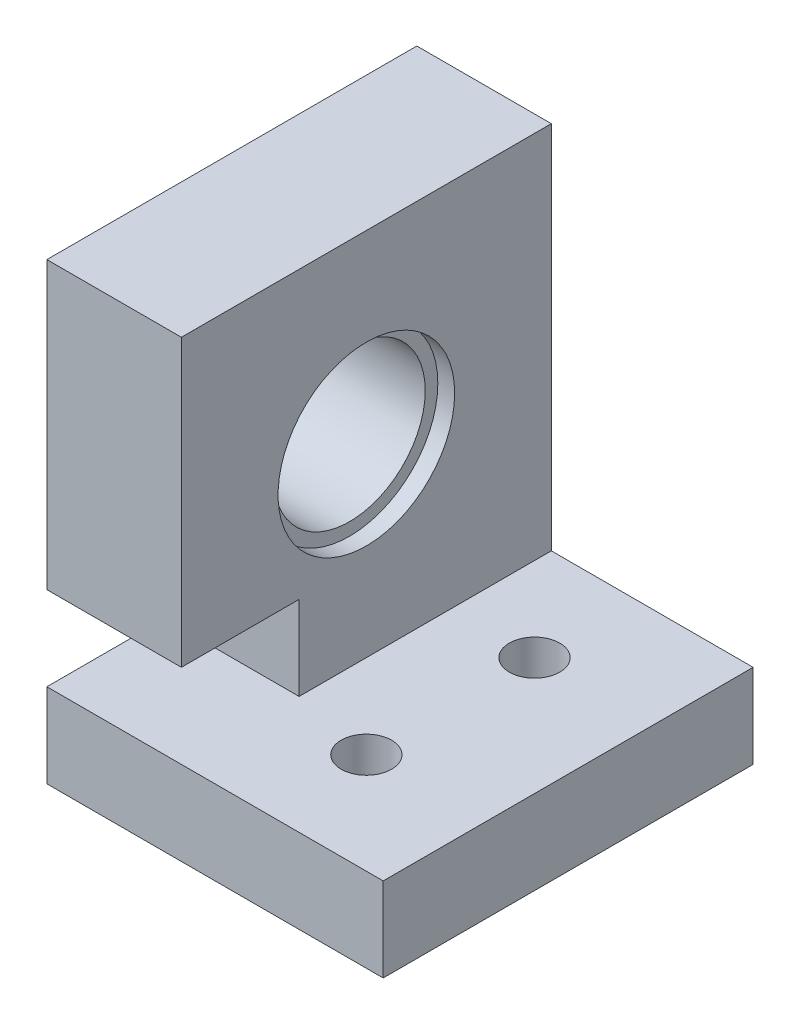
ISO-10303-21;
HEADER;
FILE_DESCRIPTION(('STEP AP214'),'2;1');
FILE_NAME('part.step','',(''),(''),'','','');
FILE_SCHEMA(('AUTOMOTIVE_DESIGN { 1 0 10303 214 1 1 1 1 }'));
ENDSEC;
DATA;
#1=APPLICATION_CONTEXT('core data for automotive mechanical design processes');
#2=APPLICATION_PROTOCOL_DEFINITION('international standard','automotive_design',2000,#1);
#3=PRODUCT_CONTEXT('',#1,'mechanical');
#4=PRODUCT('Part','Part','',(#3));
#5=PRODUCT_RELATED_PRODUCT_CATEGORY('part','',(#4));
#6=PRODUCT_DEFINITION_FORMATION('','',#4);
#7=PRODUCT_DEFINITION_CONTEXT('part definition',#1,'design');
#8=PRODUCT_DEFINITION('design','',#6,#7);
#9=PRODUCT_DEFINITION_SHAPE('','',#8);
#10=(LENGTH_UNIT() NAMED_UNIT(*) SI_UNIT(.MILLI.,.METRE.));
#11=(NAMED_UNIT(*) PLANE_ANGLE_UNIT() SI_UNIT($,.RADIAN.));
#12=(NAMED_UNIT(*) SI_UNIT($,.STERADIAN.) SOLID_ANGLE_UNIT());
#13=UNCERTAINTY_MEASURE_WITH_UNIT(LENGTH_MEASURE(1.E-05),#10,'distance_accuracy_value','');
#14=(GEOMETRIC_REPRESENTATION_CONTEXT(3) GLOBAL_UNCERTAINTY_ASSIGNED_CONTEXT((#13)) GLOBAL_UNIT_ASSIGNED_CONTEXT((#10,
#11,#12)) REPRESENTATION_CONTEXT('',''));
#15=CARTESIAN_POINT('',(0.,0.,0.));
#16=DIRECTION('',(0.,0.,1.));
#17=DIRECTION('',(1.,0.,0.));
#18=AXIS2_PLACEMENT_3D('',#15,#16,#17);
#19=CARTESIAN_POINT('',(13.,15.,-5.));
#20=DIRECTION('',(0.,-1.,0.));
#21=DIRECTION('',(0.,0.,-1.));
#22=AXIS2_PLACEMENT_3D('',#19,#20,#21);
#23=CYLINDRICAL_SURFACE('',#22,1.5);
#24=CARTESIAN_POINT('',(13.,-7.00000000000001,-5.));
#25=DIRECTION('',(0.,-1.,0.));
#26=DIRECTION('',(0.,0.,-1.));
#27=AXIS2_PLACEMENT_3D('',#24,#25,#26);
#28=CIRCLE('',#27,1.5);
#29=CARTESIAN_POINT('',(13.,-7.00000000000001,-6.5));
#30=VERTEX_POINT('',#29);
#31=EDGE_CURVE('E299',#30,#30,#28,.T.);
#32=ORIENTED_EDGE('',*,*,#31,.F.);
#33=EDGE_LOOP('',(#32));
#34=FACE_BOUND('',#33,.T.);
#35=CARTESIAN_POINT('',(13.,-9.50000000000001,-5.));
#36=DIRECTION('',(0.,-1.,0.));
#37=DIRECTION('',(0.,0.,-1.));
#38=AXIS2_PLACEMENT_3D('',#35,#36,#37);
#39=CIRCLE('',#38,1.5);
#40=CARTESIAN_POINT('',(13.,-9.50000000000001,-6.5));
#41=VERTEX_POINT('',#40);
#42=EDGE_CURVE('E307',#41,#41,#39,.F.);
#43=ORIENTED_EDGE('',*,*,#42,.F.);
#44=EDGE_LOOP('',(#43));
#45=FACE_BOUND('',#44,.T.);
#46=ADVANCED_FACE('F39',(#34,#45),#23,.F.);
#47=CARTESIAN_POINT('',(13.,15.,5.));
#48=DIRECTION('',(0.,-1.,0.));
#49=DIRECTION('',(0.,0.,-1.));
#50=AXIS2_PLACEMENT_3D('',#47,#48,#49);
#51=CYLINDRICAL_SURFACE('',#50,1.5);
#52=CARTESIAN_POINT('',(13.,-7.00000000000001,5.));
#53=DIRECTION('',(0.,-1.,0.));
#54=DIRECTION('',(0.,0.,-1.));
#55=AXIS2_PLACEMENT_3D('',#52,#53,#54);
#56=CIRCLE('',#55,1.5);
#57=CARTESIAN_POINT('',(13.,-7.00000000000001,3.5));
#58=VERTEX_POINT('',#57);
#59=EDGE_CURVE('E294',#58,#58,#56,.T.);
#60=ORIENTED_EDGE('',*,*,#59,.F.);
#61=EDGE_LOOP('',(#60));
#62=FACE_BOUND('',#61,.T.);
#63=CARTESIAN_POINT('',(13.,-9.50000000000001,5.));
#64=DIRECTION('',(0.,-1.,0.));
#65=DIRECTION('',(0.,0.,-1.));
#66=AXIS2_PLACEMENT_3D('',#63,#64,#65);
#67=CIRCLE('',#66,1.5);
#68=CARTESIAN_POINT('',(13.,-9.50000000000001,3.5));
#69=VERTEX_POINT('',#68);
#70=EDGE_CURVE('E303',#69,#69,#67,.F.);
#71=ORIENTED_EDGE('',*,*,#70,.F.);
#72=EDGE_LOOP('',(#71));
#73=FACE_BOUND('',#72,.T.);
#74=ADVANCED_FACE('F523',(#62,#73),#51,.F.);
#75=CARTESIAN_POINT('',(8.,0.,0.));
#76=DIRECTION('',(-1.,0.,0.));
#77=DIRECTION('',(0.,0.,1.));
#78=AXIS2_PLACEMENT_3D('',#75,#76,#77);
#79=PLANE('',#78);
#80=CARTESIAN_POINT('',(8.,4.,0.));
#81=DIRECTION('',(1.,0.,0.));
#82=DIRECTION('',(0.,0.,-1.));
#83=AXIS2_PLACEMENT_3D('',#80,#81,#82);
#84=CIRCLE('',#83,5.25);
#85=CARTESIAN_POINT('',(8.,4.,-5.25));
#86=VERTEX_POINT('',#85);
#87=EDGE_CURVE('E211',#86,#86,#84,.T.);
#88=ORIENTED_EDGE('',*,*,#87,.F.);
#89=EDGE_LOOP('',(#88));
#90=FACE_BOUND('',#89,.T.);
#91=DIRECTION('',(0.,0.,1.));
#92=VECTOR('',#91,1.);
#93=CARTESIAN_POINT('',(8.,-7.00000000000001,4.));
#94=LINE('',#93,#92);
#95=CARTESIAN_POINT('',(8.,-7.00000000000001,-11.));
#96=VERTEX_POINT('',#95);
#97=CARTESIAN_POINT('',(8.,-7.00000000000001,4.));
#98=VERTEX_POINT('',#97);
#99=EDGE_CURVE('E360',#96,#98,#94,.T.);
#100=ORIENTED_EDGE('',*,*,#99,.F.);
#101=DIRECTION('',(0.,-1.,0.));
#102=VECTOR('',#101,1.);
#103=CARTESIAN_POINT('',(8.,15.,-11.));
#104=LINE('',#103,#102);
#105=CARTESIAN_POINT('',(8.,15.,-11.));
#106=VERTEX_POINT('',#105);
#107=EDGE_CURVE('E260',#106,#96,#104,.T.);
#108=ORIENTED_EDGE('',*,*,#107,.F.);
#109=DIRECTION('',(0.,0.,-1.));
#110=VECTOR('',#109,1.);
#111=CARTESIAN_POINT('',(8.,15.,11.));
#112=LINE('',#111,#110);
#113=CARTESIAN_POINT('',(8.,15.,11.));
#114=VERTEX_POINT('',#113);
#115=EDGE_CURVE('E264',#114,#106,#112,.T.);
#116=ORIENTED_EDGE('',*,*,#115,.F.);
#117=DIRECTION('',(0.,-1.,0.));
#118=VECTOR('',#117,1.);
#119=CARTESIAN_POINT('',(8.,15.,11.));
#120=LINE('',#119,#118);
#121=CARTESIAN_POINT('',(8.,-2.,11.));
#122=VERTEX_POINT('',#121);
#123=EDGE_CURVE('E269',#114,#122,#120,.T.);
#124=ORIENTED_EDGE('',*,*,#123,.T.);
#125=DIRECTION('',(0.,0.,-1.));
#126=VECTOR('',#125,1.);
#127=CARTESIAN_POINT('',(8.,-2.,11.));
#128=LINE('',#127,#126);
#129=CARTESIAN_POINT('',(8.,-2.,4.));
#130=VERTEX_POINT('',#129);
#131=EDGE_CURVE('E237',#122,#130,#128,.T.);
#132=ORIENTED_EDGE('',*,*,#131,.T.);
#133=DIRECTION('',(0.,-1.,0.));
#134=VECTOR('',#133,1.);
#135=CARTESIAN_POINT('',(8.,-10.,4.));
#136=LINE('',#135,#134);
#137=EDGE_CURVE('E241',#130,#98,#136,.T.);
#138=ORIENTED_EDGE('',*,*,#137,.T.);
#139=EDGE_LOOP('',(#100,#108,#116,#124,#132,#138));
#140=FACE_BOUND('',#139,.T.);
#141=ADVANCED_FACE('F493',(#90,#140),#79,.F.);
#142=CARTESIAN_POINT('',(8.,-10.,4.));
#143=DIRECTION('',(0.,0.,-1.));
#144=DIRECTION('',(-1.,0.,0.));
#145=AXIS2_PLACEMENT_3D('',#142,#143,#144);
#146=PLANE('',#145);
#147=DIRECTION('',(-1.,0.,0.));
#148=VECTOR('',#147,1.);
#149=CARTESIAN_POINT('',(0.,-7.00000000000001,4.));
#150=LINE('',#149,#148);
#151=CARTESIAN_POINT('',(0.,-7.00000000000001,4.));
#152=VERTEX_POINT('',#151);
#153=EDGE_CURVE('E363',#98,#152,#150,.T.);
#154=ORIENTED_EDGE('',*,*,#153,.F.);
#155=ORIENTED_EDGE('',*,*,#137,.F.);
#156=DIRECTION('',(-1.,0.,0.));
#157=VECTOR('',#156,1.);
#158=CARTESIAN_POINT('',(8.,-2.,4.));
#159=LINE('',#158,#157);
#160=CARTESIAN_POINT('',(0.,-2.,4.));
#161=VERTEX_POINT('',#160);
#162=EDGE_CURVE('E254',#130,#161,#159,.T.);
#163=ORIENTED_EDGE('',*,*,#162,.T.);
#164=DIRECTION('',(0.,-1.,0.));
#165=VECTOR('',#164,1.);
#166=CARTESIAN_POINT('',(0.,-10.,4.));
#167=LINE('',#166,#165);
#168=EDGE_CURVE('E242',#161,#152,#167,.T.);
#169=ORIENTED_EDGE('',*,*,#168,.T.);
#170=EDGE_LOOP('',(#154,#155,#163,#169));
#171=FACE_BOUND('',#170,.T.);
#172=ADVANCED_FACE('F500',(#171),#146,.F.);
#173=CARTESIAN_POINT('',(8.,4.,0.));
#174=DIRECTION('',(-1.,0.,0.));
#175=DIRECTION('',(0.,0.,1.));
#176=AXIS2_PLACEMENT_3D('',#173,#174,#175);
#177=CYLINDRICAL_SURFACE('',#176,4.5);
#178=CARTESIAN_POINT('',(1.,4.,0.));
#179=DIRECTION('',(-1.,0.,0.));
#180=DIRECTION('',(0.,0.,1.));
#181=AXIS2_PLACEMENT_3D('',#178,#179,#180);
#182=CIRCLE('',#181,4.5);
#183=CARTESIAN_POINT('',(1.,4.,4.5));
#184=VERTEX_POINT('',#183);
#185=EDGE_CURVE('E232',#184,#184,#182,.F.);
#186=ORIENTED_EDGE('',*,*,#185,.F.);
#187=EDGE_LOOP('',(#186));
#188=FACE_BOUND('',#187,.T.);
#189=CARTESIAN_POINT('',(7.,4.,0.));
#190=DIRECTION('',(1.,0.,0.));
#191=DIRECTION('',(0.,0.,-1.));
#192=AXIS2_PLACEMENT_3D('',#189,#190,#191);
#193=CIRCLE('',#192,4.5);
#194=CARTESIAN_POINT('',(7.,4.,-4.5));
#195=VERTEX_POINT('',#194);
#196=EDGE_CURVE('E224',#195,#195,#193,.F.);
#197=ORIENTED_EDGE('',*,*,#196,.F.);
#198=EDGE_LOOP('',(#197));
#199=FACE_BOUND('',#198,.T.);
#200=ADVANCED_FACE('F589',(#188,#199),#177,.F.);
#201=CARTESIAN_POINT('',(8.,15.,11.));
#202=DIRECTION('',(0.,0.,-1.));
#203=DIRECTION('',(0.,1.,0.));
#204=AXIS2_PLACEMENT_3D('',#201,#202,#203);
#205=PLANE('',#204);
#206=DIRECTION('',(0.,-1.,0.));
#207=VECTOR('',#206,1.);
#208=CARTESIAN_POINT('',(0.,15.,11.));
#209=LINE('',#208,#207);
#210=CARTESIAN_POINT('',(0.,-7.00000000000001,11.));
#211=VERTEX_POINT('',#210);
#212=CARTESIAN_POINT('',(0.,-12.,11.));
#213=VERTEX_POINT('',#212);
#214=EDGE_CURVE('E197',#211,#213,#209,.T.);
#215=ORIENTED_EDGE('',*,*,#214,.T.);
#216=DIRECTION('',(-1.,0.,0.));
#217=VECTOR('',#216,1.);
#218=CARTESIAN_POINT('',(20.,-12.,11.));
#219=LINE('',#218,#217);
#220=CARTESIAN_POINT('',(20.,-12.,11.));
#221=VERTEX_POINT('',#220);
#222=EDGE_CURVE('E184',#221,#213,#219,.T.);
#223=ORIENTED_EDGE('',*,*,#222,.F.);
#224=DIRECTION('',(0.,-1.,0.));
#225=VECTOR('',#224,1.);
#226=CARTESIAN_POINT('',(20.,-10.,11.));
#227=LINE('',#226,#225);
#228=CARTESIAN_POINT('',(20.,-7.00000000000001,11.));
#229=VERTEX_POINT('',#228);
#230=EDGE_CURVE('E195',#229,#221,#227,.T.);
#231=ORIENTED_EDGE('',*,*,#230,.F.);
#232=DIRECTION('',(1.,0.,0.));
#233=VECTOR('',#232,1.);
#234=CARTESIAN_POINT('',(20.,-7.00000000000001,11.));
#235=LINE('',#234,#233);
#236=EDGE_CURVE('E352',#211,#229,#235,.T.);
#237=ORIENTED_EDGE('',*,*,#236,.F.);
#238=EDGE_LOOP('',(#215,#223,#231,#237));
#239=FACE_BOUND('',#238,.T.);
#240=ADVANCED_FACE('F193',(#239),#205,.F.);
#241=CARTESIAN_POINT('',(8.,15.,-11.));
#242=DIRECTION('',(0.,0.,-1.));
#243=DIRECTION('',(0.,1.,0.));
#244=AXIS2_PLACEMENT_3D('',#241,#242,#243);
#245=PLANE('',#244);
#246=DIRECTION('',(1.,0.,0.));
#247=VECTOR('',#246,1.);
#248=CARTESIAN_POINT('',(20.,-12.,-11.));
#249=LINE('',#248,#247);
#250=CARTESIAN_POINT('',(0.,-12.,-11.));
#251=VERTEX_POINT('',#250);
#252=CARTESIAN_POINT('',(20.,-12.,-11.));
#253=VERTEX_POINT('',#252);
#254=EDGE_CURVE('E55',#251,#253,#249,.T.);
#255=ORIENTED_EDGE('',*,*,#254,.F.);
#256=DIRECTION('',(0.,-1.,0.));
#257=VECTOR('',#256,1.);
#258=CARTESIAN_POINT('',(0.,15.,-11.));
#259=LINE('',#258,#257);
#260=CARTESIAN_POINT('',(0.,15.,-11.));
#261=VERTEX_POINT('',#260);
#262=EDGE_CURVE('E257',#261,#251,#259,.T.);
#263=ORIENTED_EDGE('',*,*,#262,.F.);
#264=DIRECTION('',(-1.,0.,0.));
#265=VECTOR('',#264,1.);
#266=CARTESIAN_POINT('',(8.,15.,-11.));
#267=LINE('',#266,#265);
#268=EDGE_CURVE('E48',#106,#261,#267,.T.);
#269=ORIENTED_EDGE('',*,*,#268,.F.);
#270=ORIENTED_EDGE('',*,*,#107,.T.);
#271=DIRECTION('',(-1.,0.,0.));
#272=VECTOR('',#271,1.);
#273=CARTESIAN_POINT('',(8.,-7.00000000000001,-11.));
#274=LINE('',#273,#272);
#275=CARTESIAN_POINT('',(20.,-7.00000000000001,-11.));
#276=VERTEX_POINT('',#275);
#277=EDGE_CURVE('E357',#276,#96,#274,.T.);
#278=ORIENTED_EDGE('',*,*,#277,.F.);
#279=DIRECTION('',(0.,1.,0.));
#280=VECTOR('',#279,1.);
#281=CARTESIAN_POINT('',(20.,-10.,-11.));
#282=LINE('',#281,#280);
#283=EDGE_CURVE('E206',#253,#276,#282,.T.);
#284=ORIENTED_EDGE('',*,*,#283,.F.);
#285=EDGE_LOOP('',(#255,#263,#269,#270,#278,#284));
#286=FACE_BOUND('',#285,.T.);
#287=ADVANCED_FACE('F41',(#286),#245,.T.);
#288=CARTESIAN_POINT('',(8.,15.,11.));
#289=DIRECTION('',(0.,1.,0.));
#290=DIRECTION('',(0.,0.,1.));
#291=AXIS2_PLACEMENT_3D('',#288,#289,#290);
#292=PLANE('',#291);
#293=DIRECTION('',(0.,0.,-1.));
#294=VECTOR('',#293,1.);
#295=CARTESIAN_POINT('',(0.,15.,11.));
#296=LINE('',#295,#294);
#297=CARTESIAN_POINT('',(0.,15.,11.));
#298=VERTEX_POINT('',#297);
#299=EDGE_CURVE('E277',#298,#261,#296,.T.);
#300=ORIENTED_EDGE('',*,*,#299,.F.);
#301=DIRECTION('',(-1.,0.,0.));
#302=VECTOR('',#301,1.);
#303=CARTESIAN_POINT('',(8.,15.,11.));
#304=LINE('',#303,#302);
#305=EDGE_CURVE('E273',#114,#298,#304,.T.);
#306=ORIENTED_EDGE('',*,*,#305,.F.);
#307=ORIENTED_EDGE('',*,*,#115,.T.);
#308=ORIENTED_EDGE('',*,*,#268,.T.);
#309=EDGE_LOOP('',(#300,#306,#307,#308));
#310=FACE_BOUND('',#309,.T.);
#311=ADVANCED_FACE('F487',(#310),#292,.T.);
#312=CARTESIAN_POINT('',(0.,-2.,11.));
#313=VERTEX_POINT('',#312);
#314=EDGE_CURVE('E265',#298,#313,#209,.T.);
#315=ORIENTED_EDGE('',*,*,#314,.T.);
#316=DIRECTION('',(-1.,0.,0.));
#317=VECTOR('',#316,1.);
#318=CARTESIAN_POINT('',(8.,-2.,11.));
#319=LINE('',#318,#317);
#320=EDGE_CURVE('E246',#122,#313,#319,.T.);
#321=ORIENTED_EDGE('',*,*,#320,.F.);
#322=ORIENTED_EDGE('',*,*,#123,.F.);
#323=ORIENTED_EDGE('',*,*,#305,.T.);
#324=EDGE_LOOP('',(#315,#321,#322,#323));
#325=FACE_BOUND('',#324,.T.);
#326=ADVANCED_FACE('F506',(#325),#205,.F.);
#327=CARTESIAN_POINT('',(0.,0.,0.));
#328=DIRECTION('',(-1.,0.,0.));
#329=DIRECTION('',(0.,0.,1.));
#330=AXIS2_PLACEMENT_3D('',#327,#328,#329);
#331=PLANE('',#330);
#332=DIRECTION('',(0.,0.,-1.));
#333=VECTOR('',#332,1.);
#334=CARTESIAN_POINT('',(0.,-12.,11.));
#335=LINE('',#334,#333);
#336=EDGE_CURVE('E199',#213,#251,#335,.T.);
#337=ORIENTED_EDGE('',*,*,#336,.F.);
#338=ORIENTED_EDGE('',*,*,#214,.F.);
#339=DIRECTION('',(0.,0.,1.));
#340=VECTOR('',#339,1.);
#341=CARTESIAN_POINT('',(0.,-7.00000000000001,11.));
#342=LINE('',#341,#340);
#343=EDGE_CURVE('E298',#152,#211,#342,.T.);
#344=ORIENTED_EDGE('',*,*,#343,.F.);
#345=ORIENTED_EDGE('',*,*,#168,.F.);
#346=DIRECTION('',(0.,0.,-1.));
#347=VECTOR('',#346,1.);
#348=CARTESIAN_POINT('',(0.,-2.,11.));
#349=LINE('',#348,#347);
#350=EDGE_CURVE('E247',#313,#161,#349,.T.);
#351=ORIENTED_EDGE('',*,*,#350,.F.);
#352=ORIENTED_EDGE('',*,*,#314,.F.);
#353=ORIENTED_EDGE('',*,*,#299,.T.);
#354=ORIENTED_EDGE('',*,*,#262,.T.);
#355=EDGE_LOOP('',(#337,#338,#344,#345,#351,#352,#353,#354));
#356=FACE_BOUND('',#355,.T.);
#357=CARTESIAN_POINT('',(0.,4.,0.));
#358=DIRECTION('',(-1.,0.,0.));
#359=DIRECTION('',(0.,0.,1.));
#360=AXIS2_PLACEMENT_3D('',#357,#358,#359);
#361=CIRCLE('',#360,5.25);
#362=CARTESIAN_POINT('',(0.,4.,5.25));
#363=VERTEX_POINT('',#362);
#364=EDGE_CURVE('E233',#363,#363,#361,.T.);
#365=ORIENTED_EDGE('',*,*,#364,.F.);
#366=EDGE_LOOP('',(#365));
#367=FACE_BOUND('',#366,.T.);
#368=ADVANCED_FACE('F481',(#356,#367),#331,.T.);
#369=CARTESIAN_POINT('',(8.,-2.,11.));
#370=DIRECTION('',(0.,1.,0.));
#371=DIRECTION('',(0.,0.,1.));
#372=AXIS2_PLACEMENT_3D('',#369,#370,#371);
#373=PLANE('',#372);
#374=ORIENTED_EDGE('',*,*,#350,.T.);
#375=ORIENTED_EDGE('',*,*,#162,.F.);
#376=ORIENTED_EDGE('',*,*,#131,.F.);
#377=ORIENTED_EDGE('',*,*,#320,.T.);
#378=EDGE_LOOP('',(#374,#375,#376,#377));
#379=FACE_BOUND('',#378,.T.);
#380=ADVANCED_FACE('F507',(#379),#373,.F.);
#381=CARTESIAN_POINT('',(1.,4.,0.));
#382=DIRECTION('',(-1.,0.,0.));
#383=DIRECTION('',(0.,0.,1.));
#384=AXIS2_PLACEMENT_3D('',#381,#382,#383);
#385=PLANE('',#384);
#386=CARTESIAN_POINT('',(1.,4.,0.));
#387=DIRECTION('',(-1.,0.,0.));
#388=DIRECTION('',(0.,0.,1.));
#389=AXIS2_PLACEMENT_3D('',#386,#387,#388);
#390=CIRCLE('',#389,5.25);
#391=CARTESIAN_POINT('',(1.,4.,5.25));
#392=VERTEX_POINT('',#391);
#393=EDGE_CURVE('E228',#392,#392,#390,.T.);
#394=ORIENTED_EDGE('',*,*,#393,.T.);
#395=EDGE_LOOP('',(#394));
#396=FACE_BOUND('',#395,.T.);
#397=ORIENTED_EDGE('',*,*,#185,.T.);
#398=EDGE_LOOP('',(#397));
#399=FACE_BOUND('',#398,.T.);
#400=ADVANCED_FACE('F509',(#396,#399),#385,.T.);
#401=CARTESIAN_POINT('',(1.,4.,0.));
#402=DIRECTION('',(-1.,0.,0.));
#403=DIRECTION('',(0.,0.,1.));
#404=AXIS2_PLACEMENT_3D('',#401,#402,#403);
#405=CYLINDRICAL_SURFACE('',#404,5.25);
#406=ORIENTED_EDGE('',*,*,#393,.F.);
#407=EDGE_LOOP('',(#406));
#408=FACE_BOUND('',#407,.T.);
#409=ORIENTED_EDGE('',*,*,#364,.T.);
#410=EDGE_LOOP('',(#409));
#411=FACE_BOUND('',#410,.T.);
#412=ADVANCED_FACE('F515',(#408,#411),#405,.F.);
#413=CARTESIAN_POINT('',(7.,4.,0.));
#414=DIRECTION('',(1.,0.,0.));
#415=DIRECTION('',(0.,0.,-1.));
#416=AXIS2_PLACEMENT_3D('',#413,#414,#415);
#417=PLANE('',#416);
#418=CARTESIAN_POINT('',(7.,4.,0.));
#419=DIRECTION('',(1.,0.,0.));
#420=DIRECTION('',(0.,0.,-1.));
#421=AXIS2_PLACEMENT_3D('',#418,#419,#420);
#422=CIRCLE('',#421,5.25);
#423=CARTESIAN_POINT('',(7.,4.,-5.25));
#424=VERTEX_POINT('',#423);
#425=EDGE_CURVE('E220',#424,#424,#422,.T.);
#426=ORIENTED_EDGE('',*,*,#425,.T.);
#427=EDGE_LOOP('',(#426));
#428=FACE_BOUND('',#427,.T.);
#429=ORIENTED_EDGE('',*,*,#196,.T.);
#430=EDGE_LOOP('',(#429));
#431=FACE_BOUND('',#430,.T.);
#432=ADVANCED_FACE('F579',(#428,#431),#417,.T.);
#433=CARTESIAN_POINT('',(7.,4.,0.));
#434=DIRECTION('',(1.,0.,0.));
#435=DIRECTION('',(0.,0.,-1.));
#436=AXIS2_PLACEMENT_3D('',#433,#434,#435);
#437=CYLINDRICAL_SURFACE('',#436,5.25);
#438=ORIENTED_EDGE('',*,*,#425,.F.);
#439=EDGE_LOOP('',(#438));
#440=FACE_BOUND('',#439,.T.);
#441=ORIENTED_EDGE('',*,*,#87,.T.);
#442=EDGE_LOOP('',(#441));
#443=FACE_BOUND('',#442,.T.);
#444=ADVANCED_FACE('F578',(#440,#443),#437,.F.);
#445=CARTESIAN_POINT('',(20.,0.,0.));
#446=DIRECTION('',(1.,0.,0.));
#447=DIRECTION('',(0.,0.,-1.));
#448=AXIS2_PLACEMENT_3D('',#445,#446,#447);
#449=PLANE('',#448);
#450=DIRECTION('',(0.,0.,1.));
#451=VECTOR('',#450,1.);
#452=CARTESIAN_POINT('',(20.,-12.,11.));
#453=LINE('',#452,#451);
#454=EDGE_CURVE('E180',#253,#221,#453,.T.);
#455=ORIENTED_EDGE('',*,*,#454,.F.);
#456=ORIENTED_EDGE('',*,*,#283,.T.);
#457=DIRECTION('',(0.,0.,-1.));
#458=VECTOR('',#457,1.);
#459=CARTESIAN_POINT('',(20.,-7.00000000000001,-11.));
#460=LINE('',#459,#458);
#461=EDGE_CURVE('E204',#229,#276,#460,.T.);
#462=ORIENTED_EDGE('',*,*,#461,.F.);
#463=ORIENTED_EDGE('',*,*,#230,.T.);
#464=EDGE_LOOP('',(#455,#456,#462,#463));
#465=FACE_BOUND('',#464,.T.);
#466=ADVANCED_FACE('F202',(#465),#449,.T.);
#467=CARTESIAN_POINT('',(11.4,-12.5,-2.2287187078898));
#468=DIRECTION('',(-0.866025403784439,0.,0.5));
#469=DIRECTION('',(0.5,0.,0.866025403784439));
#470=AXIS2_PLACEMENT_3D('',#467,#468,#469);
#471=PLANE('',#470);
#472=DIRECTION('',(0.,-1.,0.));
#473=VECTOR('',#472,1.);
#474=CARTESIAN_POINT('',(11.4,-12.5,-2.2287187078898));
#475=LINE('',#474,#473);
#476=CARTESIAN_POINT('',(11.4,-9.50000000000001,-2.22871870788981));
#477=VERTEX_POINT('',#476);
#478=CARTESIAN_POINT('',(11.4,-12.,-2.2287187078898));
#479=VERTEX_POINT('',#478);
#480=EDGE_CURVE('E207',#477,#479,#475,.T.);
#481=ORIENTED_EDGE('',*,*,#480,.T.);
#482=DIRECTION('',(-0.5,0.,-0.866025403784439));
#483=VECTOR('',#482,1.);
#484=CARTESIAN_POINT('',(11.4,-12.,-2.2287187078898));
#485=LINE('',#484,#483);
#486=CARTESIAN_POINT('',(9.8,-12.,-5.));
#487=VERTEX_POINT('',#486);
#488=EDGE_CURVE('E416',#479,#487,#485,.T.);
#489=ORIENTED_EDGE('',*,*,#488,.T.);
#490=DIRECTION('',(0.,-1.,0.));
#491=VECTOR('',#490,1.);
#492=CARTESIAN_POINT('',(9.8,-12.5,-5.));
#493=LINE('',#492,#491);
#494=CARTESIAN_POINT('',(9.8,-9.50000000000001,-5.00000000000002));
#495=VERTEX_POINT('',#494);
#496=EDGE_CURVE('E217',#495,#487,#493,.T.);
#497=ORIENTED_EDGE('',*,*,#496,.F.);
#498=DIRECTION('',(-0.499999999999995,0.,-0.866025403784441));
#499=VECTOR('',#498,1.);
#500=CARTESIAN_POINT('',(11.4,-9.50000000000001,-2.22871870788981));
#501=LINE('',#500,#499);
#502=EDGE_CURVE('E327',#477,#495,#501,.T.);
#503=ORIENTED_EDGE('',*,*,#502,.F.);
#504=EDGE_LOOP('',(#481,#489,#497,#503));
#505=FACE_BOUND('',#504,.T.);
#506=ADVANCED_FACE('F414',(#505),#471,.F.);
#507=CARTESIAN_POINT('',(14.6,-12.5,-2.2287187078898));
#508=DIRECTION('',(0.,0.,1.));
#509=DIRECTION('',(1.,0.,0.));
#510=AXIS2_PLACEMENT_3D('',#507,#508,#509);
#511=PLANE('',#510);
#512=DIRECTION('',(0.,-1.,0.));
#513=VECTOR('',#512,1.);
#514=CARTESIAN_POINT('',(14.6,-12.5,-2.2287187078898));
#515=LINE('',#514,#513);
#516=CARTESIAN_POINT('',(14.6,-9.50000000000001,-2.22871870788979));
#517=VERTEX_POINT('',#516);
#518=CARTESIAN_POINT('',(14.6,-12.,-2.22871870788979));
#519=VERTEX_POINT('',#518);
#520=EDGE_CURVE('E214',#517,#519,#515,.T.);
#521=ORIENTED_EDGE('',*,*,#520,.T.);
#522=DIRECTION('',(-1.,0.,0.));
#523=VECTOR('',#522,1.);
#524=CARTESIAN_POINT('',(14.6,-12.,-2.2287187078898));
#525=LINE('',#524,#523);
#526=EDGE_CURVE('E420',#519,#479,#525,.T.);
#527=ORIENTED_EDGE('',*,*,#526,.T.);
#528=ORIENTED_EDGE('',*,*,#480,.F.);
#529=DIRECTION('',(-1.,0.,0.));
#530=VECTOR('',#529,1.);
#531=CARTESIAN_POINT('',(14.6,-9.50000000000001,-2.22871870788979));
#532=LINE('',#531,#530);
#533=EDGE_CURVE('E433',#517,#477,#532,.T.);
#534=ORIENTED_EDGE('',*,*,#533,.F.);
#535=EDGE_LOOP('',(#521,#527,#528,#534));
#536=FACE_BOUND('',#535,.T.);
#537=ADVANCED_FACE('F440',(#536),#511,.F.);
#538=CARTESIAN_POINT('',(16.2,-12.5,-5.));
#539=DIRECTION('',(0.866025403784439,0.,0.5));
#540=DIRECTION('',(0.5,0.,-0.866025403784439));
#541=AXIS2_PLACEMENT_3D('',#538,#539,#540);
#542=PLANE('',#541);
#543=DIRECTION('',(0.,-1.,0.));
#544=VECTOR('',#543,1.);
#545=CARTESIAN_POINT('',(16.2,-12.5,-5.));
#546=LINE('',#545,#544);
#547=CARTESIAN_POINT('',(16.2,-9.50000000000001,-5.));
#548=VERTEX_POINT('',#547);
#549=CARTESIAN_POINT('',(16.2,-12.,-5.));
#550=VERTEX_POINT('',#549);
#551=EDGE_CURVE('E393',#548,#550,#546,.T.);
#552=ORIENTED_EDGE('',*,*,#551,.T.);
#553=DIRECTION('',(-0.5,0.,0.866025403784439));
#554=VECTOR('',#553,1.);
#555=CARTESIAN_POINT('',(16.2,-12.,-5.));
#556=LINE('',#555,#554);
#557=EDGE_CURVE('E426',#550,#519,#556,.T.);
#558=ORIENTED_EDGE('',*,*,#557,.T.);
#559=ORIENTED_EDGE('',*,*,#520,.F.);
#560=DIRECTION('',(-0.500000000000001,0.,0.866025403784438));
#561=VECTOR('',#560,1.);
#562=CARTESIAN_POINT('',(16.2,-9.50000000000001,-5.));
#563=LINE('',#562,#561);
#564=EDGE_CURVE('E424',#548,#517,#563,.T.);
#565=ORIENTED_EDGE('',*,*,#564,.F.);
#566=EDGE_LOOP('',(#552,#558,#559,#565));
#567=FACE_BOUND('',#566,.T.);
#568=ADVANCED_FACE('F444',(#567),#542,.F.);
#569=CARTESIAN_POINT('',(14.6,-12.5,-7.7712812921102));
#570=DIRECTION('',(0.866025403784438,0.,-0.5));
#571=DIRECTION('',(-0.5,0.,-0.866025403784438));
#572=AXIS2_PLACEMENT_3D('',#569,#570,#571);
#573=PLANE('',#572);
#574=DIRECTION('',(0.,-1.,0.));
#575=VECTOR('',#574,1.);
#576=CARTESIAN_POINT('',(14.6,-12.5,-7.7712812921102));
#577=LINE('',#576,#575);
#578=CARTESIAN_POINT('',(14.6,-9.50000000000001,-7.77128129211018));
#579=VERTEX_POINT('',#578);
#580=CARTESIAN_POINT('',(14.6,-12.,-7.7712812921102));
#581=VERTEX_POINT('',#580);
#582=EDGE_CURVE('E397',#579,#581,#577,.T.);
#583=ORIENTED_EDGE('',*,*,#582,.T.);
#584=DIRECTION('',(0.5,0.,0.866025403784438));
#585=VECTOR('',#584,1.);
#586=CARTESIAN_POINT('',(14.6,-12.,-7.7712812921102));
#587=LINE('',#586,#585);
#588=EDGE_CURVE('E446',#581,#550,#587,.T.);
#589=ORIENTED_EDGE('',*,*,#588,.T.);
#590=ORIENTED_EDGE('',*,*,#551,.F.);
#591=DIRECTION('',(0.499999999999995,0.,0.866025403784441));
#592=VECTOR('',#591,1.);
#593=CARTESIAN_POINT('',(14.6,-9.50000000000001,-7.77128129211018));
#594=LINE('',#593,#592);
#595=EDGE_CURVE('E419',#579,#548,#594,.T.);
#596=ORIENTED_EDGE('',*,*,#595,.F.);
#597=EDGE_LOOP('',(#583,#589,#590,#596));
#598=FACE_BOUND('',#597,.T.);
#599=ADVANCED_FACE('F565',(#598),#573,.F.);
#600=CARTESIAN_POINT('',(11.4,-12.5,-7.7712812921102));
#601=DIRECTION('',(0.,0.,-1.));
#602=DIRECTION('',(-1.,0.,0.));
#603=AXIS2_PLACEMENT_3D('',#600,#601,#602);
#604=PLANE('',#603);
#605=DIRECTION('',(0.,-1.,0.));
#606=VECTOR('',#605,1.);
#607=CARTESIAN_POINT('',(11.4,-12.5,-7.7712812921102));
#608=LINE('',#607,#606);
#609=CARTESIAN_POINT('',(11.4,-9.50000000000001,-7.77128129211022));
#610=VERTEX_POINT('',#609);
#611=CARTESIAN_POINT('',(11.4,-12.,-7.7712812921102));
#612=VERTEX_POINT('',#611);
#613=EDGE_CURVE('E400',#610,#612,#608,.T.);
#614=ORIENTED_EDGE('',*,*,#613,.T.);
#615=DIRECTION('',(1.,0.,0.));
#616=VECTOR('',#615,1.);
#617=CARTESIAN_POINT('',(11.4,-12.,-7.7712812921102));
#618=LINE('',#617,#616);
#619=EDGE_CURVE('E63',#612,#581,#618,.T.);
#620=ORIENTED_EDGE('',*,*,#619,.T.);
#621=ORIENTED_EDGE('',*,*,#582,.F.);
#622=DIRECTION('',(1.,0.,0.));
#623=VECTOR('',#622,1.);
#624=CARTESIAN_POINT('',(11.4,-9.50000000000001,-7.77128129211022));
#625=LINE('',#624,#623);
#626=EDGE_CURVE('E311',#610,#579,#625,.T.);
#627=ORIENTED_EDGE('',*,*,#626,.F.);
#628=EDGE_LOOP('',(#614,#620,#621,#627));
#629=FACE_BOUND('',#628,.T.);
#630=ADVANCED_FACE('F568',(#629),#604,.F.);
#631=CARTESIAN_POINT('',(9.8,-12.5,-5.));
#632=DIRECTION('',(-0.866025403784438,0.,-0.5));
#633=DIRECTION('',(-0.5,0.,0.866025403784439));
#634=AXIS2_PLACEMENT_3D('',#631,#632,#633);
#635=PLANE('',#634);
#636=ORIENTED_EDGE('',*,*,#496,.T.);
#637=DIRECTION('',(0.5,0.,-0.866025403784439));
#638=VECTOR('',#637,1.);
#639=CARTESIAN_POINT('',(9.8,-12.,-5.));
#640=LINE('',#639,#638);
#641=EDGE_CURVE('E409',#487,#612,#640,.T.);
#642=ORIENTED_EDGE('',*,*,#641,.T.);
#643=ORIENTED_EDGE('',*,*,#613,.F.);
#644=DIRECTION('',(0.500000000000007,0.,-0.866025403784434));
#645=VECTOR('',#644,1.);
#646=CARTESIAN_POINT('',(9.8,-9.50000000000001,-5.00000000000002));
#647=LINE('',#646,#645);
#648=EDGE_CURVE('E320',#495,#610,#647,.T.);
#649=ORIENTED_EDGE('',*,*,#648,.F.);
#650=EDGE_LOOP('',(#636,#642,#643,#649));
#651=FACE_BOUND('',#650,.T.);
#652=ADVANCED_FACE('F408',(#651),#635,.F.);
#653=CARTESIAN_POINT('',(11.4,-12.5,7.7712812921102));
#654=DIRECTION('',(-0.866025403784439,0.,0.5));
#655=DIRECTION('',(0.5,0.,0.866025403784439));
#656=AXIS2_PLACEMENT_3D('',#653,#654,#655);
#657=PLANE('',#656);
#658=DIRECTION('',(0.,-1.,0.));
#659=VECTOR('',#658,1.);
#660=CARTESIAN_POINT('',(11.4,-12.5,7.7712812921102));
#661=LINE('',#660,#659);
#662=CARTESIAN_POINT('',(11.4,-9.50000000000001,7.77128129211019));
#663=VERTEX_POINT('',#662);
#664=CARTESIAN_POINT('',(11.4,-12.,7.7712812921102));
#665=VERTEX_POINT('',#664);
#666=EDGE_CURVE('E367',#663,#665,#661,.T.);
#667=ORIENTED_EDGE('',*,*,#666,.T.);
#668=DIRECTION('',(-0.5,0.,-0.866025403784439));
#669=VECTOR('',#668,1.);
#670=CARTESIAN_POINT('',(11.4,-12.,7.7712812921102));
#671=LINE('',#670,#669);
#672=CARTESIAN_POINT('',(9.8,-12.,5.));
#673=VERTEX_POINT('',#672);
#674=EDGE_CURVE('E454',#665,#673,#671,.T.);
#675=ORIENTED_EDGE('',*,*,#674,.T.);
#676=DIRECTION('',(0.,-1.,0.));
#677=VECTOR('',#676,1.);
#678=CARTESIAN_POINT('',(9.8,-12.5,5.));
#679=LINE('',#678,#677);
#680=CARTESIAN_POINT('',(9.8,-9.50000000000001,4.99999999999998));
#681=VERTEX_POINT('',#680);
#682=EDGE_CURVE('E366',#681,#673,#679,.T.);
#683=ORIENTED_EDGE('',*,*,#682,.F.);
#684=DIRECTION('',(-0.499999999999995,0.,-0.866025403784441));
#685=VECTOR('',#684,1.);
#686=CARTESIAN_POINT('',(11.4,-9.50000000000001,7.77128129211019));
#687=LINE('',#686,#685);
#688=EDGE_CURVE('E338',#663,#681,#687,.T.);
#689=ORIENTED_EDGE('',*,*,#688,.F.);
#690=EDGE_LOOP('',(#667,#675,#683,#689));
#691=FACE_BOUND('',#690,.T.);
#692=ADVANCED_FACE('F541',(#691),#657,.F.);
#693=CARTESIAN_POINT('',(14.6,-12.5,7.7712812921102));
#694=DIRECTION('',(0.,0.,1.));
#695=DIRECTION('',(1.,0.,0.));
#696=AXIS2_PLACEMENT_3D('',#693,#694,#695);
#697=PLANE('',#696);
#698=DIRECTION('',(0.,-1.,0.));
#699=VECTOR('',#698,1.);
#700=CARTESIAN_POINT('',(14.6,-12.5,7.7712812921102));
#701=LINE('',#700,#699);
#702=CARTESIAN_POINT('',(14.6,-9.50000000000001,7.77128129211021));
#703=VERTEX_POINT('',#702);
#704=CARTESIAN_POINT('',(14.6,-12.,7.77128129211021));
#705=VERTEX_POINT('',#704);
#706=EDGE_CURVE('E371',#703,#705,#701,.T.);
#707=ORIENTED_EDGE('',*,*,#706,.T.);
#708=DIRECTION('',(-1.,0.,0.));
#709=VECTOR('',#708,1.);
#710=CARTESIAN_POINT('',(14.6,-12.,7.7712812921102));
#711=LINE('',#710,#709);
#712=EDGE_CURVE('E458',#705,#665,#711,.T.);
#713=ORIENTED_EDGE('',*,*,#712,.T.);
#714=ORIENTED_EDGE('',*,*,#666,.F.);
#715=DIRECTION('',(-1.,0.,0.));
#716=VECTOR('',#715,1.);
#717=CARTESIAN_POINT('',(14.6,-9.50000000000001,7.77128129211021));
#718=LINE('',#717,#716);
#719=EDGE_CURVE('E334',#703,#663,#718,.T.);
#720=ORIENTED_EDGE('',*,*,#719,.F.);
#721=EDGE_LOOP('',(#707,#713,#714,#720));
#722=FACE_BOUND('',#721,.T.);
#723=ADVANCED_FACE('F537',(#722),#697,.F.);
#724=CARTESIAN_POINT('',(16.2,-12.5,5.));
#725=DIRECTION('',(0.866025403784439,0.,0.5));
#726=DIRECTION('',(0.5,0.,-0.866025403784439));
#727=AXIS2_PLACEMENT_3D('',#724,#725,#726);
#728=PLANE('',#727);
#729=DIRECTION('',(0.,-1.,0.));
#730=VECTOR('',#729,1.);
#731=CARTESIAN_POINT('',(16.2,-12.5,5.));
#732=LINE('',#731,#730);
#733=CARTESIAN_POINT('',(16.2,-9.50000000000001,5.));
#734=VERTEX_POINT('',#733);
#735=CARTESIAN_POINT('',(16.2,-12.,5.));
#736=VERTEX_POINT('',#735);
#737=EDGE_CURVE('E375',#734,#736,#732,.T.);
#738=ORIENTED_EDGE('',*,*,#737,.T.);
#739=DIRECTION('',(-0.5,0.,0.866025403784439));
#740=VECTOR('',#739,1.);
#741=CARTESIAN_POINT('',(16.2,-12.,5.));
#742=LINE('',#741,#740);
#743=EDGE_CURVE('E462',#736,#705,#742,.T.);
#744=ORIENTED_EDGE('',*,*,#743,.T.);
#745=ORIENTED_EDGE('',*,*,#706,.F.);
#746=DIRECTION('',(-0.500000000000001,0.,0.866025403784438));
#747=VECTOR('',#746,1.);
#748=CARTESIAN_POINT('',(16.2,-9.50000000000001,5.));
#749=LINE('',#748,#747);
#750=EDGE_CURVE('E317',#734,#703,#749,.T.);
#751=ORIENTED_EDGE('',*,*,#750,.F.);
#752=EDGE_LOOP('',(#738,#744,#745,#751));
#753=FACE_BOUND('',#752,.T.);
#754=ADVANCED_FACE('F540',(#753),#728,.F.);
#755=CARTESIAN_POINT('',(14.6,-12.5,2.2287187078898));
#756=DIRECTION('',(0.866025403784438,0.,-0.5));
#757=DIRECTION('',(-0.5,0.,-0.866025403784438));
#758=AXIS2_PLACEMENT_3D('',#755,#756,#757);
#759=PLANE('',#758);
#760=DIRECTION('',(0.,-1.,0.));
#761=VECTOR('',#760,1.);
#762=CARTESIAN_POINT('',(14.6,-12.5,2.2287187078898));
#763=LINE('',#762,#761);
#764=CARTESIAN_POINT('',(14.6,-9.50000000000001,2.22871870788982));
#765=VERTEX_POINT('',#764);
#766=CARTESIAN_POINT('',(14.6,-12.,2.2287187078898));
#767=VERTEX_POINT('',#766);
#768=EDGE_CURVE('E379',#765,#767,#763,.T.);
#769=ORIENTED_EDGE('',*,*,#768,.T.);
#770=DIRECTION('',(0.5,0.,0.866025403784438));
#771=VECTOR('',#770,1.);
#772=CARTESIAN_POINT('',(14.6,-12.,2.2287187078898));
#773=LINE('',#772,#771);
#774=EDGE_CURVE('E466',#767,#736,#773,.T.);
#775=ORIENTED_EDGE('',*,*,#774,.T.);
#776=ORIENTED_EDGE('',*,*,#737,.F.);
#777=DIRECTION('',(0.499999999999995,0.,0.866025403784441));
#778=VECTOR('',#777,1.);
#779=CARTESIAN_POINT('',(14.6,-9.50000000000001,2.22871870788982));
#780=LINE('',#779,#778);
#781=EDGE_CURVE('E310',#765,#734,#780,.T.);
#782=ORIENTED_EDGE('',*,*,#781,.F.);
#783=EDGE_LOOP('',(#769,#775,#776,#782));
#784=FACE_BOUND('',#783,.T.);
#785=ADVANCED_FACE('F545',(#784),#759,.F.);
#786=CARTESIAN_POINT('',(11.4,-12.5,2.2287187078898));
#787=DIRECTION('',(0.,0.,-1.));
#788=DIRECTION('',(-1.,0.,0.));
#789=AXIS2_PLACEMENT_3D('',#786,#787,#788);
#790=PLANE('',#789);
#791=DIRECTION('',(0.,-1.,0.));
#792=VECTOR('',#791,1.);
#793=CARTESIAN_POINT('',(11.4,-12.5,2.2287187078898));
#794=LINE('',#793,#792);
#795=CARTESIAN_POINT('',(11.4,-9.50000000000001,2.22871870788978));
#796=VERTEX_POINT('',#795);
#797=CARTESIAN_POINT('',(11.4,-12.,2.2287187078898));
#798=VERTEX_POINT('',#797);
#799=EDGE_CURVE('E383',#796,#798,#794,.T.);
#800=ORIENTED_EDGE('',*,*,#799,.T.);
#801=DIRECTION('',(1.,0.,0.));
#802=VECTOR('',#801,1.);
#803=CARTESIAN_POINT('',(11.4,-12.,2.2287187078898));
#804=LINE('',#803,#802);
#805=EDGE_CURVE('E470',#798,#767,#804,.T.);
#806=ORIENTED_EDGE('',*,*,#805,.T.);
#807=ORIENTED_EDGE('',*,*,#768,.F.);
#808=DIRECTION('',(1.,0.,0.));
#809=VECTOR('',#808,1.);
#810=CARTESIAN_POINT('',(11.4,-9.50000000000001,2.22871870788978));
#811=LINE('',#810,#809);
#812=EDGE_CURVE('E306',#796,#765,#811,.T.);
#813=ORIENTED_EDGE('',*,*,#812,.F.);
#814=EDGE_LOOP('',(#800,#806,#807,#813));
#815=FACE_BOUND('',#814,.T.);
#816=ADVANCED_FACE('F549',(#815),#790,.F.);
#817=CARTESIAN_POINT('',(9.8,-12.5,5.));
#818=DIRECTION('',(-0.866025403784438,0.,-0.5));
#819=DIRECTION('',(-0.5,0.,0.866025403784439));
#820=AXIS2_PLACEMENT_3D('',#817,#818,#819);
#821=PLANE('',#820);
#822=ORIENTED_EDGE('',*,*,#682,.T.);
#823=DIRECTION('',(0.5,0.,-0.866025403784439));
#824=VECTOR('',#823,1.);
#825=CARTESIAN_POINT('',(9.8,-12.,5.));
#826=LINE('',#825,#824);
#827=EDGE_CURVE('E11',#673,#798,#826,.T.);
#828=ORIENTED_EDGE('',*,*,#827,.T.);
#829=ORIENTED_EDGE('',*,*,#799,.F.);
#830=DIRECTION('',(0.500000000000007,0.,-0.866025403784434));
#831=VECTOR('',#830,1.);
#832=CARTESIAN_POINT('',(9.8,-9.50000000000001,4.99999999999998));
#833=LINE('',#832,#831);
#834=EDGE_CURVE('E342',#681,#796,#833,.T.);
#835=ORIENTED_EDGE('',*,*,#834,.F.);
#836=EDGE_LOOP('',(#822,#828,#829,#835));
#837=FACE_BOUND('',#836,.T.);
#838=ADVANCED_FACE('F553',(#837),#821,.F.);
#839=CARTESIAN_POINT('',(0.,-7.00000000000001,0.));
#840=DIRECTION('',(0.,-1.,0.));
#841=DIRECTION('',(0.,0.,-1.));
#842=AXIS2_PLACEMENT_3D('',#839,#840,#841);
#843=PLANE('',#842);
#844=ORIENTED_EDGE('',*,*,#31,.T.);
#845=EDGE_LOOP('',(#844));
#846=FACE_BOUND('',#845,.T.);
#847=ORIENTED_EDGE('',*,*,#59,.T.);
#848=EDGE_LOOP('',(#847));
#849=FACE_BOUND('',#848,.T.);
#850=ORIENTED_EDGE('',*,*,#343,.T.);
#851=ORIENTED_EDGE('',*,*,#236,.T.);
#852=ORIENTED_EDGE('',*,*,#461,.T.);
#853=ORIENTED_EDGE('',*,*,#277,.T.);
#854=ORIENTED_EDGE('',*,*,#99,.T.);
#855=ORIENTED_EDGE('',*,*,#153,.T.);
#856=EDGE_LOOP('',(#850,#851,#852,#853,#854,#855));
#857=FACE_BOUND('',#856,.T.);
#858=ADVANCED_FACE('F497',(#846,#849,#857),#843,.F.);
#859=CARTESIAN_POINT('',(0.,-9.50000000000001,0.));
#860=DIRECTION('',(0.,-1.,0.));
#861=DIRECTION('',(0.,0.,-1.));
#862=AXIS2_PLACEMENT_3D('',#859,#860,#861);
#863=PLANE('',#862);
#864=ORIENTED_EDGE('',*,*,#781,.T.);
#865=ORIENTED_EDGE('',*,*,#750,.T.);
#866=ORIENTED_EDGE('',*,*,#719,.T.);
#867=ORIENTED_EDGE('',*,*,#688,.T.);
#868=ORIENTED_EDGE('',*,*,#834,.T.);
#869=ORIENTED_EDGE('',*,*,#812,.T.);
#870=EDGE_LOOP('',(#864,#865,#866,#867,#868,#869));
#871=FACE_BOUND('',#870,.T.);
#872=ORIENTED_EDGE('',*,*,#70,.T.);
#873=EDGE_LOOP('',(#872));
#874=FACE_BOUND('',#873,.T.);
#875=ADVANCED_FACE('F627',(#871,#874),#863,.T.);
#876=CARTESIAN_POINT('',(0.,-9.50000000000001,-10.));
#877=DIRECTION('',(0.,-1.,0.));
#878=DIRECTION('',(0.,0.,-1.));
#879=AXIS2_PLACEMENT_3D('',#876,#877,#878);
#880=PLANE('',#879);
#881=ORIENTED_EDGE('',*,*,#595,.T.);
#882=ORIENTED_EDGE('',*,*,#564,.T.);
#883=ORIENTED_EDGE('',*,*,#533,.T.);
#884=ORIENTED_EDGE('',*,*,#502,.T.);
#885=ORIENTED_EDGE('',*,*,#648,.T.);
#886=ORIENTED_EDGE('',*,*,#626,.T.);
#887=EDGE_LOOP('',(#881,#882,#883,#884,#885,#886));
#888=FACE_BOUND('',#887,.T.);
#889=ORIENTED_EDGE('',*,*,#42,.T.);
#890=EDGE_LOOP('',(#889));
#891=FACE_BOUND('',#890,.T.);
#892=ADVANCED_FACE('F436',(#888,#891),#880,.T.);
#893=CARTESIAN_POINT('',(0.,-12.,0.));
#894=DIRECTION('',(0.,1.,0.));
#895=DIRECTION('',(0.,0.,1.));
#896=AXIS2_PLACEMENT_3D('',#893,#894,#895);
#897=PLANE('',#896);
#898=ORIENTED_EDGE('',*,*,#454,.T.);
#899=ORIENTED_EDGE('',*,*,#222,.T.);
#900=ORIENTED_EDGE('',*,*,#336,.T.);
#901=ORIENTED_EDGE('',*,*,#254,.T.);
#902=EDGE_LOOP('',(#898,#899,#900,#901));
#903=FACE_BOUND('',#902,.T.);
#904=ORIENTED_EDGE('',*,*,#712,.F.);
#905=ORIENTED_EDGE('',*,*,#743,.F.);
#906=ORIENTED_EDGE('',*,*,#774,.F.);
#907=ORIENTED_EDGE('',*,*,#805,.F.);
#908=ORIENTED_EDGE('',*,*,#827,.F.);
#909=ORIENTED_EDGE('',*,*,#674,.F.);
#910=EDGE_LOOP('',(#904,#905,#906,#907,#908,#909));
#911=FACE_BOUND('',#910,.T.);
#912=ORIENTED_EDGE('',*,*,#526,.F.);
#913=ORIENTED_EDGE('',*,*,#557,.F.);
#914=ORIENTED_EDGE('',*,*,#588,.F.);
#915=ORIENTED_EDGE('',*,*,#619,.F.);
#916=ORIENTED_EDGE('',*,*,#641,.F.);
#917=ORIENTED_EDGE('',*,*,#488,.F.);
#918=EDGE_LOOP('',(#912,#913,#914,#915,#916,#917));
#919=FACE_BOUND('',#918,.T.);
#920=ADVANCED_FACE('F182',(#903,#911,#919),#897,.F.);
#921=CLOSED_SHELL('',(#46,#74,#141,#172,#200,#240,#287,#311,#326,#368,#380,#400,#412,#432,#444,
#466,#506,#537,#568,#599,#630,#652,#692,#723,#754,#785,#816,#838,#858,#875,#892,#920));
#922=MANIFOLD_SOLID_BREP('B2',#921);
#923=ADVANCED_BREP_SHAPE_REPRESENTATION('',(#18,#922),#14);
#924=SHAPE_DEFINITION_REPRESENTATION(#9,#923);
ENDSEC;
END-ISO-10303-21;
